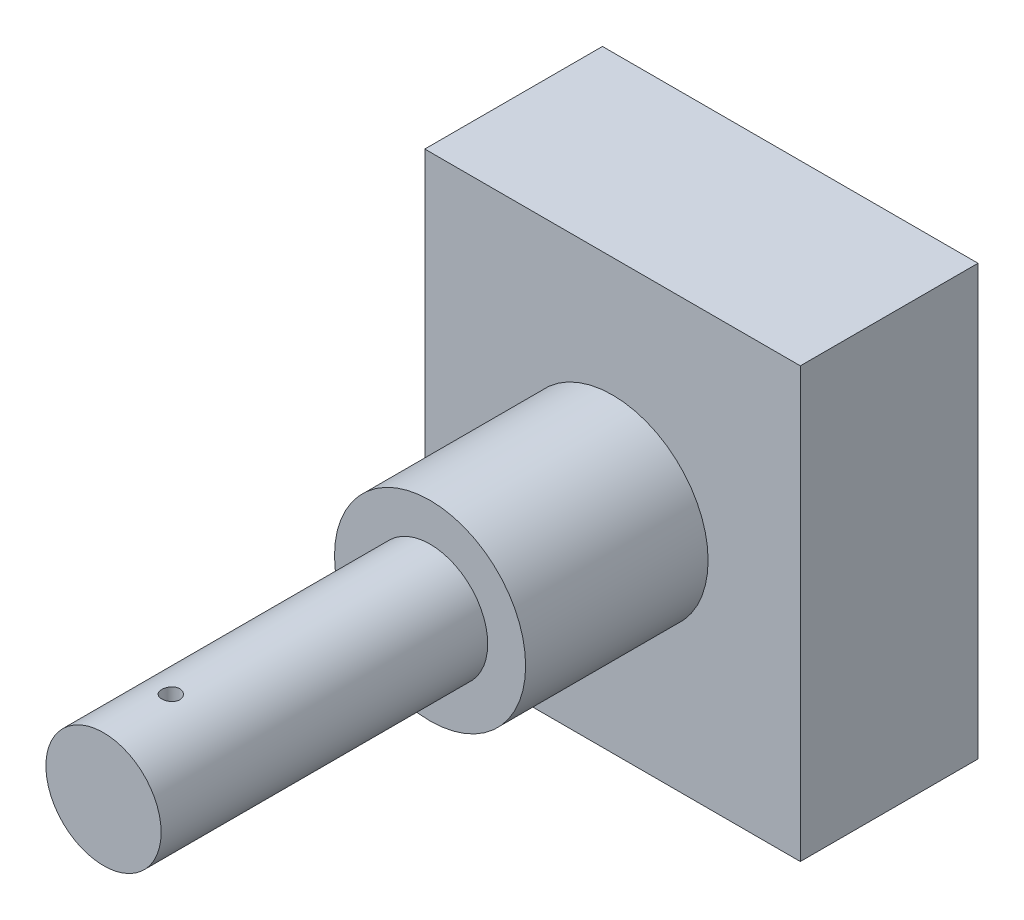
ISO-10303-21;
HEADER;
FILE_DESCRIPTION(('STEP AP214'),'2;1');
FILE_NAME('part.step','',(''),(''),'','','');
FILE_SCHEMA(('AUTOMOTIVE_DESIGN { 1 0 10303 214 1 1 1 1 }'));
ENDSEC;
DATA;
#1=APPLICATION_CONTEXT('core data for automotive mechanical design processes');
#2=APPLICATION_PROTOCOL_DEFINITION('international standard','automotive_design',2000,#1);
#3=PRODUCT_CONTEXT('',#1,'mechanical');
#4=PRODUCT('Part','Part','',(#3));
#5=PRODUCT_RELATED_PRODUCT_CATEGORY('part','',(#4));
#6=PRODUCT_DEFINITION_FORMATION('','',#4);
#7=PRODUCT_DEFINITION_CONTEXT('part definition',#1,'design');
#8=PRODUCT_DEFINITION('design','',#6,#7);
#9=PRODUCT_DEFINITION_SHAPE('','',#8);
#10=(LENGTH_UNIT() NAMED_UNIT(*) SI_UNIT(.MILLI.,.METRE.));
#11=(NAMED_UNIT(*) PLANE_ANGLE_UNIT() SI_UNIT($,.RADIAN.));
#12=(NAMED_UNIT(*) SI_UNIT($,.STERADIAN.) SOLID_ANGLE_UNIT());
#13=UNCERTAINTY_MEASURE_WITH_UNIT(LENGTH_MEASURE(1.E-05),#10,'distance_accuracy_value','');
#14=(GEOMETRIC_REPRESENTATION_CONTEXT(3) GLOBAL_UNCERTAINTY_ASSIGNED_CONTEXT((#13)) GLOBAL_UNIT_ASSIGNED_CONTEXT((#10,
#11,#12)) REPRESENTATION_CONTEXT('',''));
#15=CARTESIAN_POINT('',(0.,0.,0.));
#16=DIRECTION('',(0.,0.,1.));
#17=DIRECTION('',(1.,0.,0.));
#18=AXIS2_PLACEMENT_3D('',#15,#16,#17);
#19=CARTESIAN_POINT('',(0.,0.,26.5));
#20=DIRECTION('',(0.,0.,-1.));
#21=DIRECTION('',(-1.,0.,0.));
#22=AXIS2_PLACEMENT_3D('',#19,#20,#21);
#23=CYLINDRICAL_SURFACE('',#22,3.);
#24=CARTESIAN_POINT('',(0.,0.,26.5));
#25=DIRECTION('',(0.,0.,1.));
#26=DIRECTION('',(1.,0.,0.));
#27=AXIS2_PLACEMENT_3D('',#24,#25,#26);
#28=CIRCLE('',#27,3.);
#29=CARTESIAN_POINT('',(3.,0.,26.5));
#30=VERTEX_POINT('',#29);
#31=EDGE_CURVE('E183',#30,#30,#28,.T.);
#32=ORIENTED_EDGE('',*,*,#31,.F.);
#33=EDGE_LOOP('',(#32));
#34=FACE_BOUND('',#33,.T.);
#35=CARTESIAN_POINT('',(0.,0.,9.5));
#36=DIRECTION('',(0.,0.,1.));
#37=DIRECTION('',(1.,0.,0.));
#38=AXIS2_PLACEMENT_3D('',#35,#36,#37);
#39=CIRCLE('',#38,3.);
#40=CARTESIAN_POINT('',(3.,0.,9.5));
#41=VERTEX_POINT('',#40);
#42=EDGE_CURVE('E13',#41,#41,#39,.T.);
#43=ORIENTED_EDGE('',*,*,#42,.T.);
#44=EDGE_LOOP('',(#43));
#45=FACE_BOUND('',#44,.T.);
#46=CARTESIAN_POINT('',(0.,-3.,23.465864978709));
#47=CARTESIAN_POINT('',(-0.0260001432440054,-2.99999957345454,23.4658639151282));
#48=CARTESIAN_POINT('',(-0.0520150990498731,-2.99965846056392,23.4636810087096));
#49=CARTESIAN_POINT('',(-0.103317093603655,-2.99833052852713,23.455009703853));
#50=CARTESIAN_POINT('',(-0.128603411453787,-2.99734309137477,23.4485171845397));
#51=CARTESIAN_POINT('',(-0.177698327370747,-2.99483341177364,23.4314259721762));
#52=CARTESIAN_POINT('',(-0.201508054053534,-2.99331158385917,23.4208304612205));
#53=CARTESIAN_POINT('',(-0.24700820112381,-2.98990102883176,23.3958419837416));
#54=CARTESIAN_POINT('',(-0.26869889933856,-2.98801234991419,23.3814495159581));
#55=CARTESIAN_POINT('',(-0.309529810575292,-2.98406028798294,23.3491477119637));
#56=CARTESIAN_POINT('',(-0.328649767743696,-2.98199570565759,23.3312129154756));
#57=CARTESIAN_POINT('',(-0.363621622889192,-2.9779338511697,23.2923903520489));
#58=CARTESIAN_POINT('',(-0.379473327451064,-2.97593658299665,23.2715024104663));
#59=CARTESIAN_POINT('',(-0.407538280523249,-2.97222386729606,23.2272294421591));
#60=CARTESIAN_POINT('',(-0.41973179672463,-2.97050996977732,23.203831765702));
#61=CARTESIAN_POINT('',(-0.440008117685485,-2.96757450928224,23.1552893742113));
#62=CARTESIAN_POINT('',(-0.448091162774418,-2.96635291752283,23.1301447614145));
#63=CARTESIAN_POINT('',(-0.459853901260591,-2.96455222057661,23.0790358276734));
#64=CARTESIAN_POINT('',(-0.463568365609218,-2.96396804472234,23.0530796912255));
#65=CARTESIAN_POINT('',(-0.466596247663485,-2.96349294578393,23.0009064715899));
#66=CARTESIAN_POINT('',(-0.465909935979073,-2.96360198007331,22.9746894045461));
#67=CARTESIAN_POINT('',(-0.460184134554073,-2.96449634725054,22.922984945053));
#68=CARTESIAN_POINT('',(-0.455183472853701,-2.96527564772223,22.8974931333239));
#69=CARTESIAN_POINT('',(-0.441031750122118,-2.96741331051545,22.8477148188007));
#70=CARTESIAN_POINT('',(-0.431880563995268,-2.96877169029022,22.8234283523598));
#71=CARTESIAN_POINT('',(-0.409647490081268,-2.97192107495436,22.7766325774452));
#72=CARTESIAN_POINT('',(-0.396549254982881,-2.97371387288458,22.7541311613408));
#73=CARTESIAN_POINT('',(-0.366805524968743,-2.97752881081532,22.7116308827919));
#74=CARTESIAN_POINT('',(-0.350159780811766,-2.97955096692542,22.6916321963411));
#75=CARTESIAN_POINT('',(-0.313580894472021,-2.98362338383461,22.6544801178007));
#76=CARTESIAN_POINT('',(-0.293614390134987,-2.98567371335502,22.6373595636421));
#77=CARTESIAN_POINT('',(-0.251074197509384,-2.98955133200828,22.606707201184));
#78=CARTESIAN_POINT('',(-0.228500496272772,-2.99137862003336,22.5931754107083));
#79=CARTESIAN_POINT('',(-0.181357492385286,-2.99460638065626,22.5700826082139));
#80=CARTESIAN_POINT('',(-0.156786872902335,-2.99600656867056,22.5605242422189));
#81=CARTESIAN_POINT('',(-0.106362565119654,-2.99822001809243,22.5456787523957));
#82=CARTESIAN_POINT('',(-0.0805089699943211,-2.9990333220552,22.5403913188771));
#83=CARTESIAN_POINT('',(-0.0285358966365615,-2.99997570361056,22.5342817106418));
#84=CARTESIAN_POINT('',(-0.00242184384562372,-3.00011169555934,22.5334144107494));
#85=CARTESIAN_POINT('',(0.049578678141101,-2.99970298766061,22.5360497508584));
#86=CARTESIAN_POINT('',(0.0754651548748668,-2.99915831044503,22.5395522455662));
#87=CARTESIAN_POINT('',(0.126138190875759,-2.99745374167838,22.5507902243803));
#88=CARTESIAN_POINT('',(0.150929767330764,-2.99629706216685,22.5585036146331));
#89=CARTESIAN_POINT('',(0.198867829791609,-2.99349772907858,22.5779210530383));
#90=CARTESIAN_POINT('',(0.222014233726105,-2.99185505127832,22.5896253001107));
#91=CARTESIAN_POINT('',(0.266202597064697,-2.98824899175458,22.616797306072));
#92=CARTESIAN_POINT('',(0.287226838364097,-2.9862832210304,22.6322935559883));
#93=CARTESIAN_POINT('',(0.326392451029185,-2.98225691605981,22.6665701653577));
#94=CARTESIAN_POINT('',(0.344533642001704,-2.98019637589404,22.6853507301568));
#95=CARTESIAN_POINT('',(0.377583332497152,-2.97619070945577,22.7258642144671));
#96=CARTESIAN_POINT('',(0.392461508002774,-2.97424677854984,22.7476220077789));
#97=CARTESIAN_POINT('',(0.418351745329558,-2.97071595210677,22.7933544832647));
#98=CARTESIAN_POINT('',(0.429363917392387,-2.96912904638927,22.8173291021997));
#99=CARTESIAN_POINT('',(0.447163055744511,-2.96650069798155,22.8667259833304));
#100=CARTESIAN_POINT('',(0.45396571455632,-2.96545723175252,22.8921424785974));
#101=CARTESIAN_POINT('',(0.463202504872894,-2.96402861938838,22.9437747043983));
#102=CARTESIAN_POINT('',(0.465636961714808,-2.96364342422632,22.9699903752628));
#103=CARTESIAN_POINT('',(0.466060092666415,-2.96357688554648,23.022174373978));
#104=CARTESIAN_POINT('',(0.464096460887909,-2.96388799112085,23.0481423179769));
#105=CARTESIAN_POINT('',(0.455881644038733,-2.96516254735223,23.0993737828601));
#106=CARTESIAN_POINT('',(0.449630467864369,-2.96612599665569,23.1246373052059));
#107=CARTESIAN_POINT('',(0.433035312491694,-2.96859397325053,23.1737279644296));
#108=CARTESIAN_POINT('',(0.422694904857457,-2.97009802826885,23.1975563339086));
#109=CARTESIAN_POINT('',(0.398219600069852,-2.9734782837224,23.2431477495272));
#110=CARTESIAN_POINT('',(0.384084555940345,-2.97535449857161,23.2649107156242));
#111=CARTESIAN_POINT('',(0.352248870852495,-2.97929184666787,23.3059954668972));
#112=CARTESIAN_POINT('',(0.334512975063109,-2.98135468681187,23.3252897736854));
#113=CARTESIAN_POINT('',(0.296053542504613,-2.98541880198127,23.3606450486401));
#114=CARTESIAN_POINT('',(0.275329314002541,-2.98742006262189,23.376705266118));
#115=CARTESIAN_POINT('',(0.231336543223894,-2.99114914088873,23.405222127434));
#116=CARTESIAN_POINT('',(0.208053655631759,-2.99287526839483,23.4176568599362));
#117=CARTESIAN_POINT('',(0.159713433420363,-2.99584307305834,23.438420288431));
#118=CARTESIAN_POINT('',(0.134657945305351,-2.99708524581746,23.4467531872897));
#119=CARTESIAN_POINT('',(0.0912454526510122,-2.99866543808363,23.4572109055185));
#120=CARTESIAN_POINT('',(0.0731548516351937,-2.99916329667554,23.4604511512356));
#121=CARTESIAN_POINT('',(0.036711959998478,-2.99983072596797,23.4647785484888));
#122=CARTESIAN_POINT('',(0.0183596729930807,-3.00000030119969,23.4658657297432));
#123=CARTESIAN_POINT('',(0.,-3.,23.465864978709));
#124=B_SPLINE_CURVE_WITH_KNOTS('',3,(#46,#47,#48,#49,#50,#51,#52,#53,#54,#55,#56,#57,#58,#59,
#60,#61,#62,#63,#64,#65,#66,#67,#68,#69,#70,#71,#72,#73,#74,#75,#76,#77,#78,#79,#80,#81,#82,#83,
#84,#85,#86,#87,#88,#89,#90,#91,#92,#93,#94,#95,#96,#97,#98,#99,#100,#101,#102,#103,#104,#105,
#106,#107,#108,#109,#110,#111,#112,#113,#114,#115,#116,#117,#118,#119,#120,#121,#122,#123),
.UNSPECIFIED.,.T.,.F.,(4,2,2,2,2,2,2,2,2,2,2,2,2,2,2,2,2,2,2,2,2,2,2,2,2,2,2,2,2,2,2,2,2,2,2,2,
2,2,4),(0.,0.0779333349497527,0.15594129773385,0.233888881851959,0.311826232455021,
0.390345595270063,0.468869603528801,0.547809855404456,0.626745491300713,0.705048507126894,
0.783346708035978,0.860947509829511,0.938550650644821,1.01647972044674,1.09441426720264,
1.173185180543,1.25195648509777,1.33078016214215,1.40959812307577,1.48760979574466,
1.56561887463072,1.64322253284974,1.72083005970426,1.79903962547698,1.87725408291643,
1.95616720250567,2.03507807165189,2.11369297056873,2.1923020141224,2.27006273108202,
2.34782328669496,2.42551607515103,2.50321187328512,2.58170862083741,2.66022356790759,
2.73920364067304,2.81810261867319,2.87313501912082,2.9281666599664),.UNSPECIFIED.);
#125=CARTESIAN_POINT('',(0.,-3.,23.465864978709));
#126=VERTEX_POINT('',#125);
#127=EDGE_CURVE('E124',#126,#126,#124,.T.);
#128=ORIENTED_EDGE('',*,*,#127,.F.);
#129=EDGE_LOOP('',(#128));
#130=FACE_BOUND('',#129,.T.);
#131=CARTESIAN_POINT('',(0.,3.,22.534135021291));
#132=CARTESIAN_POINT('',(0.0260001432440054,2.99999957345454,22.5341360848718));
#133=CARTESIAN_POINT('',(0.0520150990498731,2.99965846056392,22.5363189912904));
#134=CARTESIAN_POINT('',(0.103317093603655,2.99833052852713,22.544990296147));
#135=CARTESIAN_POINT('',(0.128603411453787,2.99734309137477,22.5514828154603));
#136=CARTESIAN_POINT('',(0.177698327370747,2.99483341177364,22.5685740278238));
#137=CARTESIAN_POINT('',(0.201508054053534,2.99331158385917,22.5791695387795));
#138=CARTESIAN_POINT('',(0.24700820112381,2.98990102883176,22.6041580162584));
#139=CARTESIAN_POINT('',(0.26869889933856,2.98801234991419,22.6185504840419));
#140=CARTESIAN_POINT('',(0.309529810575292,2.98406028798294,22.6508522880363));
#141=CARTESIAN_POINT('',(0.328649767743697,2.98199570565759,22.6687870845244));
#142=CARTESIAN_POINT('',(0.363621622889193,2.9779338511697,22.7076096479511));
#143=CARTESIAN_POINT('',(0.379473327451065,2.97593658299665,22.7284975895337));
#144=CARTESIAN_POINT('',(0.407538280523249,2.97222386729606,22.7727705578409));
#145=CARTESIAN_POINT('',(0.41973179672463,2.97050996977732,22.796168234298));
#146=CARTESIAN_POINT('',(0.440008117685485,2.96757450928224,22.8447106257887));
#147=CARTESIAN_POINT('',(0.448091162774418,2.96635291752283,22.8698552385855));
#148=CARTESIAN_POINT('',(0.45985390126059,2.96455222057661,22.9209641723266));
#149=CARTESIAN_POINT('',(0.463568365609218,2.96396804472234,22.9469203087745));
#150=CARTESIAN_POINT('',(0.466596247663486,2.96349294578393,22.9990935284101));
#151=CARTESIAN_POINT('',(0.465909935979073,2.96360198007331,23.0253105954539));
#152=CARTESIAN_POINT('',(0.460184134554073,2.96449634725054,23.077015054947));
#153=CARTESIAN_POINT('',(0.455183472853701,2.96527564772223,23.1025068666761));
#154=CARTESIAN_POINT('',(0.441031750122117,2.96741331051545,23.1522851811993));
#155=CARTESIAN_POINT('',(0.431880563995268,2.96877169029022,23.1765716476402));
#156=CARTESIAN_POINT('',(0.409647490081268,2.97192107495436,23.2233674225548));
#157=CARTESIAN_POINT('',(0.396549254982882,2.97371387288458,23.2458688386592));
#158=CARTESIAN_POINT('',(0.366805524968743,2.97752881081532,23.2883691172081));
#159=CARTESIAN_POINT('',(0.350159780811766,2.97955096692542,23.3083678036589));
#160=CARTESIAN_POINT('',(0.313580894472022,2.98362338383461,23.3455198821993));
#161=CARTESIAN_POINT('',(0.293614390134989,2.98567371335502,23.3626404363579));
#162=CARTESIAN_POINT('',(0.251074197509385,2.98955133200828,23.393292798816));
#163=CARTESIAN_POINT('',(0.228500496272773,2.99137862003336,23.4068245892917));
#164=CARTESIAN_POINT('',(0.181357492385286,2.99460638065626,23.4299173917861));
#165=CARTESIAN_POINT('',(0.156786872902335,2.99600656867056,23.4394757577811));
#166=CARTESIAN_POINT('',(0.106362565119654,2.99822001809243,23.4543212476043));
#167=CARTESIAN_POINT('',(0.0805089699943211,2.9990333220552,23.4596086811229));
#168=CARTESIAN_POINT('',(0.0285358966365615,2.99997570361056,23.4657182893582));
#169=CARTESIAN_POINT('',(0.0024218438456237,3.00011169555934,23.4665855892506));
#170=CARTESIAN_POINT('',(-0.0495786781411009,2.99970298766061,23.4639502491416));
#171=CARTESIAN_POINT('',(-0.0754651548748668,2.99915831044503,23.4604477544338));
#172=CARTESIAN_POINT('',(-0.126138190875759,2.99745374167838,23.4492097756197));
#173=CARTESIAN_POINT('',(-0.150929767330764,2.99629706216685,23.4414963853669));
#174=CARTESIAN_POINT('',(-0.198867829791609,2.99349772907858,23.4220789469617));
#175=CARTESIAN_POINT('',(-0.222014233726105,2.99185505127832,23.4103746998893));
#176=CARTESIAN_POINT('',(-0.266202597064696,2.98824899175458,23.383202693928));
#177=CARTESIAN_POINT('',(-0.287226838364096,2.9862832210304,23.3677064440117));
#178=CARTESIAN_POINT('',(-0.326392451029184,2.98225691605981,23.3334298346423));
#179=CARTESIAN_POINT('',(-0.344533642001703,2.98019637589404,23.3146492698432));
#180=CARTESIAN_POINT('',(-0.377583332497152,2.97619070945577,23.2741357855329));
#181=CARTESIAN_POINT('',(-0.392461508002774,2.97424677854984,23.2523779922211));
#182=CARTESIAN_POINT('',(-0.418351745329558,2.97071595210677,23.2066455167353));
#183=CARTESIAN_POINT('',(-0.429363917392387,2.96912904638927,23.1826708978003));
#184=CARTESIAN_POINT('',(-0.447163055744511,2.96650069798155,23.1332740166696));
#185=CARTESIAN_POINT('',(-0.45396571455632,2.96545723175252,23.1078575214026));
#186=CARTESIAN_POINT('',(-0.463202504872893,2.96402861938838,23.0562252956017));
#187=CARTESIAN_POINT('',(-0.465636961714807,2.96364342422632,23.0300096247372));
#188=CARTESIAN_POINT('',(-0.466060092666415,2.96357688554648,22.977825626022));
#189=CARTESIAN_POINT('',(-0.464096460887909,2.96388799112085,22.9518576820231));
#190=CARTESIAN_POINT('',(-0.455881644038733,2.96516254735223,22.9006262171399));
#191=CARTESIAN_POINT('',(-0.449630467864369,2.96612599665569,22.8753626947941));
#192=CARTESIAN_POINT('',(-0.433035312491694,2.96859397325053,22.8262720355704));
#193=CARTESIAN_POINT('',(-0.422694904857457,2.97009802826885,22.8024436660914));
#194=CARTESIAN_POINT('',(-0.398219600069852,2.9734782837224,22.7568522504728));
#195=CARTESIAN_POINT('',(-0.384084555940345,2.97535449857161,22.7350892843758));
#196=CARTESIAN_POINT('',(-0.352248870852494,2.97929184666787,22.6940045331028));
#197=CARTESIAN_POINT('',(-0.334512975063107,2.98135468681187,22.6747102263146));
#198=CARTESIAN_POINT('',(-0.296053542504611,2.98541880198127,22.6393549513599));
#199=CARTESIAN_POINT('',(-0.27532931400254,2.98742006262189,22.623294733882));
#200=CARTESIAN_POINT('',(-0.231336543223894,2.99114914088873,22.594777872566));
#201=CARTESIAN_POINT('',(-0.208053655631759,2.99287526839483,22.5823431400638));
#202=CARTESIAN_POINT('',(-0.159713433420363,2.99584307305834,22.561579711569));
#203=CARTESIAN_POINT('',(-0.134657945305351,2.99708524581746,22.5532468127103));
#204=CARTESIAN_POINT('',(-0.0912454526510122,2.99866543808363,22.5427890944815));
#205=CARTESIAN_POINT('',(-0.0731548516351937,2.99916329667554,22.5395488487644));
#206=CARTESIAN_POINT('',(-0.036711959998478,2.99983072596797,22.5352214515112));
#207=CARTESIAN_POINT('',(-0.0183596729930807,3.00000030119969,22.5341342702568));
#208=CARTESIAN_POINT('',(0.,3.,22.534135021291));
#209=B_SPLINE_CURVE_WITH_KNOTS('',3,(#131,#132,#133,#134,#135,#136,#137,#138,#139,#140,#141,
#142,#143,#144,#145,#146,#147,#148,#149,#150,#151,#152,#153,#154,#155,#156,#157,#158,#159,#160,
#161,#162,#163,#164,#165,#166,#167,#168,#169,#170,#171,#172,#173,#174,#175,#176,#177,#178,#179,
#180,#181,#182,#183,#184,#185,#186,#187,#188,#189,#190,#191,#192,#193,#194,#195,#196,#197,#198,
#199,#200,#201,#202,#203,#204,#205,#206,#207,#208),.UNSPECIFIED.,.T.,.F.,(4,2,2,2,2,2,2,2,2,2,2,
2,2,2,2,2,2,2,2,2,2,2,2,2,2,2,2,2,2,2,2,2,2,2,2,2,2,2,4),(0.,0.0779333349497527,
0.15594129773385,0.233888881851959,0.311826232455021,0.390345595270066,0.468869603528801,
0.547809855404456,0.626745491300713,0.70504850712689,0.783346708035977,0.860947509829515,
0.938550650644821,1.01647972044674,1.09441426720263,1.17318518054299,1.25195648509777,
1.33078016214215,1.40959812307577,1.48760979574466,1.56561887463072,1.64322253284974,
1.72083005970426,1.79903962547697,1.87725408291643,1.95616720250567,2.03507807165189,
2.11369297056872,2.1923020141224,2.27006273108203,2.34782328669496,2.42551607515103,
2.50321187328512,2.58170862083741,2.66022356790759,2.73920364067304,2.81810261867319,
2.87313501912082,2.9281666599664),.UNSPECIFIED.);
#210=CARTESIAN_POINT('',(0.,3.,22.534135021291));
#211=VERTEX_POINT('',#210);
#212=EDGE_CURVE('E132',#211,#211,#209,.T.);
#213=ORIENTED_EDGE('',*,*,#212,.T.);
#214=EDGE_LOOP('',(#213));
#215=FACE_BOUND('',#214,.T.);
#216=ADVANCED_FACE('F45',(#34,#45,#130,#215),#23,.T.);
#217=CARTESIAN_POINT('',(0.,0.,9.5));
#218=DIRECTION('',(0.,0.,-1.));
#219=DIRECTION('',(-1.,0.,0.));
#220=AXIS2_PLACEMENT_3D('',#217,#218,#219);
#221=CYLINDRICAL_SURFACE('',#220,4.975);
#222=CARTESIAN_POINT('',(0.,0.,9.5));
#223=DIRECTION('',(0.,0.,1.));
#224=DIRECTION('',(1.,0.,0.));
#225=AXIS2_PLACEMENT_3D('',#222,#223,#224);
#226=CIRCLE('',#225,4.975);
#227=CARTESIAN_POINT('',(4.975,0.,9.5));
#228=VERTEX_POINT('',#227);
#229=EDGE_CURVE('E55',#228,#228,#226,.T.);
#230=ORIENTED_EDGE('',*,*,#229,.F.);
#231=EDGE_LOOP('',(#230));
#232=FACE_BOUND('',#231,.T.);
#233=CARTESIAN_POINT('',(0.,0.,0.));
#234=DIRECTION('',(0.,0.,1.));
#235=DIRECTION('',(1.,0.,0.));
#236=AXIS2_PLACEMENT_3D('',#233,#234,#235);
#237=CIRCLE('',#236,4.975);
#238=CARTESIAN_POINT('',(4.975,0.,0.));
#239=VERTEX_POINT('',#238);
#240=EDGE_CURVE('E49',#239,#239,#237,.T.);
#241=ORIENTED_EDGE('',*,*,#240,.T.);
#242=EDGE_LOOP('',(#241));
#243=FACE_BOUND('',#242,.T.);
#244=ADVANCED_FACE('F47',(#232,#243),#221,.T.);
#245=CARTESIAN_POINT('',(0.,0.,9.5));
#246=DIRECTION('',(0.,0.,1.));
#247=DIRECTION('',(1.,0.,0.));
#248=AXIS2_PLACEMENT_3D('',#245,#246,#247);
#249=PLANE('',#248);
#250=ORIENTED_EDGE('',*,*,#42,.F.);
#251=EDGE_LOOP('',(#250));
#252=FACE_BOUND('',#251,.T.);
#253=ORIENTED_EDGE('',*,*,#229,.T.);
#254=EDGE_LOOP('',(#253));
#255=FACE_BOUND('',#254,.T.);
#256=ADVANCED_FACE('F167',(#252,#255),#249,.T.);
#257=CARTESIAN_POINT('',(0.,0.,26.5));
#258=DIRECTION('',(0.,0.,1.));
#259=DIRECTION('',(1.,0.,0.));
#260=AXIS2_PLACEMENT_3D('',#257,#258,#259);
#261=PLANE('',#260);
#262=ORIENTED_EDGE('',*,*,#31,.T.);
#263=EDGE_LOOP('',(#262));
#264=FACE_BOUND('',#263,.T.);
#265=ADVANCED_FACE('F172',(#264),#261,.T.);
#266=CARTESIAN_POINT('',(0.,4.976,23.));
#267=DIRECTION('',(0.,-1.,0.));
#268=DIRECTION('',(0.,0.,-1.));
#269=AXIS2_PLACEMENT_3D('',#266,#267,#268);
#270=CYLINDRICAL_SURFACE('',#269,0.465864978709048);
#271=ORIENTED_EDGE('',*,*,#212,.F.);
#272=EDGE_LOOP('',(#271));
#273=FACE_BOUND('',#272,.T.);
#274=ORIENTED_EDGE('',*,*,#127,.T.);
#275=EDGE_LOOP('',(#274));
#276=FACE_BOUND('',#275,.T.);
#277=ADVANCED_FACE('F145',(#273,#276),#270,.F.);
#278=CARTESIAN_POINT('',(-9.775,11.175,-9.25));
#279=DIRECTION('',(1.,0.,0.));
#280=DIRECTION('',(0.,1.,0.));
#281=AXIS2_PLACEMENT_3D('',#278,#279,#280);
#282=PLANE('',#281);
#283=DIRECTION('',(0.,1.,0.));
#284=VECTOR('',#283,1.);
#285=CARTESIAN_POINT('',(-9.775,11.175,0.));
#286=LINE('',#285,#284);
#287=CARTESIAN_POINT('',(-9.775,-11.175,0.));
#288=VERTEX_POINT('',#287);
#289=CARTESIAN_POINT('',(-9.775,11.175,0.));
#290=VERTEX_POINT('',#289);
#291=EDGE_CURVE('E115',#288,#290,#286,.T.);
#292=ORIENTED_EDGE('',*,*,#291,.T.);
#293=DIRECTION('',(0.,0.,1.));
#294=VECTOR('',#293,1.);
#295=CARTESIAN_POINT('',(-9.775,11.175,-9.25));
#296=LINE('',#295,#294);
#297=CARTESIAN_POINT('',(-9.775,11.175,-9.25));
#298=VERTEX_POINT('',#297);
#299=EDGE_CURVE('E106',#298,#290,#296,.T.);
#300=ORIENTED_EDGE('',*,*,#299,.F.);
#301=DIRECTION('',(0.,1.,0.));
#302=VECTOR('',#301,1.);
#303=CARTESIAN_POINT('',(-9.775,11.175,-9.25));
#304=LINE('',#303,#302);
#305=CARTESIAN_POINT('',(-9.775,-11.175,-9.25));
#306=VERTEX_POINT('',#305);
#307=EDGE_CURVE('E100',#306,#298,#304,.T.);
#308=ORIENTED_EDGE('',*,*,#307,.F.);
#309=DIRECTION('',(0.,0.,1.));
#310=VECTOR('',#309,1.);
#311=CARTESIAN_POINT('',(-9.775,-11.175,-9.25));
#312=LINE('',#311,#310);
#313=EDGE_CURVE('E111',#306,#288,#312,.T.);
#314=ORIENTED_EDGE('',*,*,#313,.T.);
#315=EDGE_LOOP('',(#292,#300,#308,#314));
#316=FACE_BOUND('',#315,.T.);
#317=ADVANCED_FACE('F142',(#316),#282,.F.);
#318=CARTESIAN_POINT('',(9.775,11.175,-9.25));
#319=DIRECTION('',(0.,-1.,0.));
#320=DIRECTION('',(0.,0.,-1.));
#321=AXIS2_PLACEMENT_3D('',#318,#319,#320);
#322=PLANE('',#321);
#323=DIRECTION('',(1.,0.,0.));
#324=VECTOR('',#323,1.);
#325=CARTESIAN_POINT('',(9.775,11.175,0.));
#326=LINE('',#325,#324);
#327=CARTESIAN_POINT('',(9.775,11.175,0.));
#328=VERTEX_POINT('',#327);
#329=EDGE_CURVE('E105',#290,#328,#326,.T.);
#330=ORIENTED_EDGE('',*,*,#329,.T.);
#331=DIRECTION('',(0.,0.,1.));
#332=VECTOR('',#331,1.);
#333=CARTESIAN_POINT('',(9.775,11.175,-9.25));
#334=LINE('',#333,#332);
#335=CARTESIAN_POINT('',(9.775,11.175,-9.25));
#336=VERTEX_POINT('',#335);
#337=EDGE_CURVE('E103',#336,#328,#334,.T.);
#338=ORIENTED_EDGE('',*,*,#337,.F.);
#339=DIRECTION('',(1.,0.,0.));
#340=VECTOR('',#339,1.);
#341=CARTESIAN_POINT('',(9.775,11.175,-9.25));
#342=LINE('',#341,#340);
#343=EDGE_CURVE('E95',#298,#336,#342,.T.);
#344=ORIENTED_EDGE('',*,*,#343,.F.);
#345=ORIENTED_EDGE('',*,*,#299,.T.);
#346=EDGE_LOOP('',(#330,#338,#344,#345));
#347=FACE_BOUND('',#346,.T.);
#348=ADVANCED_FACE('F104',(#347),#322,.F.);
#349=CARTESIAN_POINT('',(9.775,11.175,-9.25));
#350=DIRECTION('',(-1.,0.,0.));
#351=DIRECTION('',(0.,-1.,0.));
#352=AXIS2_PLACEMENT_3D('',#349,#350,#351);
#353=PLANE('',#352);
#354=DIRECTION('',(0.,-1.,0.));
#355=VECTOR('',#354,1.);
#356=CARTESIAN_POINT('',(9.775,11.175,0.));
#357=LINE('',#356,#355);
#358=CARTESIAN_POINT('',(9.775,-11.175,0.));
#359=VERTEX_POINT('',#358);
#360=EDGE_CURVE('E81',#328,#359,#357,.T.);
#361=ORIENTED_EDGE('',*,*,#360,.T.);
#362=DIRECTION('',(0.,0.,1.));
#363=VECTOR('',#362,1.);
#364=CARTESIAN_POINT('',(9.775,-11.175,-9.25));
#365=LINE('',#364,#363);
#366=CARTESIAN_POINT('',(9.775,-11.175,-9.25));
#367=VERTEX_POINT('',#366);
#368=EDGE_CURVE('E107',#367,#359,#365,.T.);
#369=ORIENTED_EDGE('',*,*,#368,.F.);
#370=DIRECTION('',(0.,-1.,0.));
#371=VECTOR('',#370,1.);
#372=CARTESIAN_POINT('',(9.775,11.175,-9.25));
#373=LINE('',#372,#371);
#374=EDGE_CURVE('E98',#336,#367,#373,.T.);
#375=ORIENTED_EDGE('',*,*,#374,.F.);
#376=ORIENTED_EDGE('',*,*,#337,.T.);
#377=EDGE_LOOP('',(#361,#369,#375,#376));
#378=FACE_BOUND('',#377,.T.);
#379=ADVANCED_FACE('F109',(#378),#353,.F.);
#380=CARTESIAN_POINT('',(9.775,-11.175,-9.25));
#381=DIRECTION('',(0.,1.,0.));
#382=DIRECTION('',(0.,0.,1.));
#383=AXIS2_PLACEMENT_3D('',#380,#381,#382);
#384=PLANE('',#383);
#385=DIRECTION('',(-1.,0.,0.));
#386=VECTOR('',#385,1.);
#387=CARTESIAN_POINT('',(9.775,-11.175,0.));
#388=LINE('',#387,#386);
#389=EDGE_CURVE('E87',#359,#288,#388,.T.);
#390=ORIENTED_EDGE('',*,*,#389,.T.);
#391=ORIENTED_EDGE('',*,*,#313,.F.);
#392=DIRECTION('',(-1.,0.,0.));
#393=VECTOR('',#392,1.);
#394=CARTESIAN_POINT('',(9.775,-11.175,-9.25));
#395=LINE('',#394,#393);
#396=EDGE_CURVE('E64',#367,#306,#395,.T.);
#397=ORIENTED_EDGE('',*,*,#396,.F.);
#398=ORIENTED_EDGE('',*,*,#368,.T.);
#399=EDGE_LOOP('',(#390,#391,#397,#398));
#400=FACE_BOUND('',#399,.T.);
#401=ADVANCED_FACE('F151',(#400),#384,.F.);
#402=CARTESIAN_POINT('',(0.,0.,-9.25));
#403=DIRECTION('',(0.,0.,-1.));
#404=DIRECTION('',(-1.,0.,0.));
#405=AXIS2_PLACEMENT_3D('',#402,#403,#404);
#406=PLANE('',#405);
#407=ORIENTED_EDGE('',*,*,#307,.T.);
#408=ORIENTED_EDGE('',*,*,#343,.T.);
#409=ORIENTED_EDGE('',*,*,#374,.T.);
#410=ORIENTED_EDGE('',*,*,#396,.T.);
#411=EDGE_LOOP('',(#407,#408,#409,#410));
#412=FACE_BOUND('',#411,.T.);
#413=ADVANCED_FACE('F96',(#412),#406,.T.);
#414=CARTESIAN_POINT('',(0.,0.,0.));
#415=DIRECTION('',(0.,0.,-1.));
#416=DIRECTION('',(-1.,0.,0.));
#417=AXIS2_PLACEMENT_3D('',#414,#415,#416);
#418=PLANE('',#417);
#419=ORIENTED_EDGE('',*,*,#240,.F.);
#420=EDGE_LOOP('',(#419));
#421=FACE_BOUND('',#420,.T.);
#422=ORIENTED_EDGE('',*,*,#291,.F.);
#423=ORIENTED_EDGE('',*,*,#389,.F.);
#424=ORIENTED_EDGE('',*,*,#360,.F.);
#425=ORIENTED_EDGE('',*,*,#329,.F.);
#426=EDGE_LOOP('',(#422,#423,#424,#425));
#427=FACE_BOUND('',#426,.T.);
#428=ADVANCED_FACE('F154',(#421,#427),#418,.F.);
#429=CLOSED_SHELL('',(#216,#244,#256,#265,#277,#317,#348,#379,#401,#413,#428));
#430=MANIFOLD_SOLID_BREP('B2',#429);
#431=ADVANCED_BREP_SHAPE_REPRESENTATION('',(#18,#430),#14);
#432=SHAPE_DEFINITION_REPRESENTATION(#9,#431);
ENDSEC;
END-ISO-10303-21;
